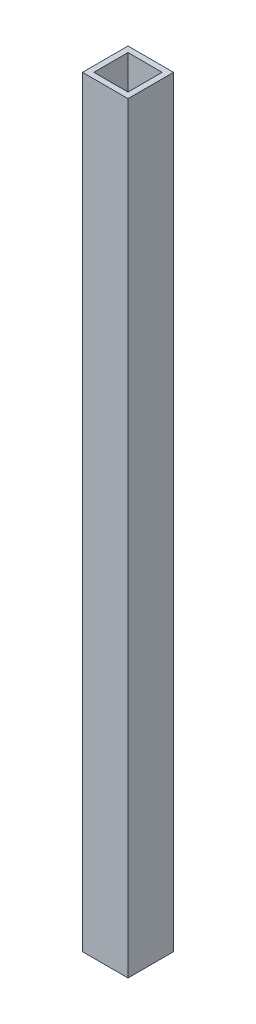
ISO-10303-21;
HEADER;
FILE_DESCRIPTION(('STEP AP214'),'2;1');
FILE_NAME('part.step','',(''),(''),'','','');
FILE_SCHEMA(('AUTOMOTIVE_DESIGN { 1 0 10303 214 1 1 1 1 }'));
ENDSEC;
DATA;
#1=APPLICATION_CONTEXT('core data for automotive mechanical design processes');
#2=APPLICATION_PROTOCOL_DEFINITION('international standard','automotive_design',2000,#1);
#3=PRODUCT_CONTEXT('',#1,'mechanical');
#4=PRODUCT('Part','Part','',(#3));
#5=PRODUCT_RELATED_PRODUCT_CATEGORY('part','',(#4));
#6=PRODUCT_DEFINITION_FORMATION('','',#4);
#7=PRODUCT_DEFINITION_CONTEXT('part definition',#1,'design');
#8=PRODUCT_DEFINITION('design','',#6,#7);
#9=PRODUCT_DEFINITION_SHAPE('','',#8);
#10=(LENGTH_UNIT() NAMED_UNIT(*) SI_UNIT(.MILLI.,.METRE.));
#11=(NAMED_UNIT(*) PLANE_ANGLE_UNIT() SI_UNIT($,.RADIAN.));
#12=(NAMED_UNIT(*) SI_UNIT($,.STERADIAN.) SOLID_ANGLE_UNIT());
#13=UNCERTAINTY_MEASURE_WITH_UNIT(LENGTH_MEASURE(1.E-05),#10,'distance_accuracy_value','');
#14=(GEOMETRIC_REPRESENTATION_CONTEXT(3) GLOBAL_UNCERTAINTY_ASSIGNED_CONTEXT((#13)) GLOBAL_UNIT_ASSIGNED_CONTEXT((#10,
#11,#12)) REPRESENTATION_CONTEXT('',''));
#15=CARTESIAN_POINT('',(0.,0.,0.));
#16=DIRECTION('',(0.,0.,1.));
#17=DIRECTION('',(1.,0.,0.));
#18=AXIS2_PLACEMENT_3D('',#15,#16,#17);
#19=CARTESIAN_POINT('',(0.,424.434,12.7));
#20=DIRECTION('',(0.,0.,-1.));
#21=DIRECTION('',(-1.,0.,0.));
#22=AXIS2_PLACEMENT_3D('',#19,#20,#21);
#23=PLANE('',#22);
#24=DIRECTION('',(1.,0.,0.));
#25=VECTOR('',#24,1.);
#26=CARTESIAN_POINT('',(0.,0.,12.7));
#27=LINE('',#26,#25);
#28=CARTESIAN_POINT('',(-12.7,0.,12.7));
#29=VERTEX_POINT('',#28);
#30=CARTESIAN_POINT('',(12.7,0.,12.7));
#31=VERTEX_POINT('',#30);
#32=EDGE_CURVE('E142',#29,#31,#27,.T.);
#33=ORIENTED_EDGE('',*,*,#32,.T.);
#34=DIRECTION('',(0.,-1.,0.));
#35=VECTOR('',#34,1.);
#36=CARTESIAN_POINT('',(12.7,424.434,12.7));
#37=LINE('',#36,#35);
#38=CARTESIAN_POINT('',(12.7,424.434,12.7));
#39=VERTEX_POINT('',#38);
#40=EDGE_CURVE('E11',#39,#31,#37,.T.);
#41=ORIENTED_EDGE('',*,*,#40,.F.);
#42=DIRECTION('',(1.,0.,0.));
#43=VECTOR('',#42,1.);
#44=CARTESIAN_POINT('',(0.,424.434,12.7));
#45=LINE('',#44,#43);
#46=CARTESIAN_POINT('',(-12.7,424.434,12.7));
#47=VERTEX_POINT('',#46);
#48=EDGE_CURVE('E114',#47,#39,#45,.T.);
#49=ORIENTED_EDGE('',*,*,#48,.F.);
#50=DIRECTION('',(0.,-1.,0.));
#51=VECTOR('',#50,1.);
#52=CARTESIAN_POINT('',(-12.7,424.434,12.7));
#53=LINE('',#52,#51);
#54=EDGE_CURVE('E54',#47,#29,#53,.T.);
#55=ORIENTED_EDGE('',*,*,#54,.T.);
#56=EDGE_LOOP('',(#33,#41,#49,#55));
#57=FACE_BOUND('',#56,.T.);
#58=ADVANCED_FACE('F35',(#57),#23,.F.);
#59=CARTESIAN_POINT('',(12.7,424.434,0.));
#60=DIRECTION('',(-1.,0.,0.));
#61=DIRECTION('',(0.,0.,1.));
#62=AXIS2_PLACEMENT_3D('',#59,#60,#61);
#63=PLANE('',#62);
#64=DIRECTION('',(0.,0.,-1.));
#65=VECTOR('',#64,1.);
#66=CARTESIAN_POINT('',(12.7,0.,0.));
#67=LINE('',#66,#65);
#68=CARTESIAN_POINT('',(12.7,0.,-12.7));
#69=VERTEX_POINT('',#68);
#70=EDGE_CURVE('E120',#31,#69,#67,.T.);
#71=ORIENTED_EDGE('',*,*,#70,.T.);
#72=DIRECTION('',(0.,-1.,0.));
#73=VECTOR('',#72,1.);
#74=CARTESIAN_POINT('',(12.7,424.434,-12.7));
#75=LINE('',#74,#73);
#76=CARTESIAN_POINT('',(12.7,424.434,-12.7));
#77=VERTEX_POINT('',#76);
#78=EDGE_CURVE('E45',#77,#69,#75,.T.);
#79=ORIENTED_EDGE('',*,*,#78,.F.);
#80=DIRECTION('',(0.,0.,-1.));
#81=VECTOR('',#80,1.);
#82=CARTESIAN_POINT('',(12.7,424.434,0.));
#83=LINE('',#82,#81);
#84=EDGE_CURVE('E108',#39,#77,#83,.T.);
#85=ORIENTED_EDGE('',*,*,#84,.F.);
#86=ORIENTED_EDGE('',*,*,#40,.T.);
#87=EDGE_LOOP('',(#71,#79,#85,#86));
#88=FACE_BOUND('',#87,.T.);
#89=ADVANCED_FACE('F119',(#88),#63,.F.);
#90=CARTESIAN_POINT('',(0.,424.434,-12.7));
#91=DIRECTION('',(0.,0.,-1.));
#92=DIRECTION('',(-1.,0.,0.));
#93=AXIS2_PLACEMENT_3D('',#90,#91,#92);
#94=PLANE('',#93);
#95=DIRECTION('',(1.,0.,0.));
#96=VECTOR('',#95,1.);
#97=CARTESIAN_POINT('',(0.,0.,-12.7));
#98=LINE('',#97,#96);
#99=CARTESIAN_POINT('',(-12.7,0.,-12.7));
#100=VERTEX_POINT('',#99);
#101=EDGE_CURVE('E145',#100,#69,#98,.T.);
#102=ORIENTED_EDGE('',*,*,#101,.F.);
#103=DIRECTION('',(0.,-1.,0.));
#104=VECTOR('',#103,1.);
#105=CARTESIAN_POINT('',(-12.7,424.434,-12.7));
#106=LINE('',#105,#104);
#107=CARTESIAN_POINT('',(-12.7,424.434,-12.7));
#108=VERTEX_POINT('',#107);
#109=EDGE_CURVE('E80',#108,#100,#106,.T.);
#110=ORIENTED_EDGE('',*,*,#109,.F.);
#111=DIRECTION('',(1.,0.,0.));
#112=VECTOR('',#111,1.);
#113=CARTESIAN_POINT('',(0.,424.434,-12.7));
#114=LINE('',#113,#112);
#115=EDGE_CURVE('E113',#108,#77,#114,.T.);
#116=ORIENTED_EDGE('',*,*,#115,.T.);
#117=ORIENTED_EDGE('',*,*,#78,.T.);
#118=EDGE_LOOP('',(#102,#110,#116,#117));
#119=FACE_BOUND('',#118,.T.);
#120=ADVANCED_FACE('F124',(#119),#94,.T.);
#121=CARTESIAN_POINT('',(0.,424.434,9.525));
#122=DIRECTION('',(0.,0.,-1.));
#123=DIRECTION('',(-1.,0.,0.));
#124=AXIS2_PLACEMENT_3D('',#121,#122,#123);
#125=PLANE('',#124);
#126=DIRECTION('',(1.,0.,0.));
#127=VECTOR('',#126,1.);
#128=CARTESIAN_POINT('',(0.,0.,9.525));
#129=LINE('',#128,#127);
#130=CARTESIAN_POINT('',(-9.525,0.,9.525));
#131=VERTEX_POINT('',#130);
#132=CARTESIAN_POINT('',(9.525,0.,9.525));
#133=VERTEX_POINT('',#132);
#134=EDGE_CURVE('E131',#131,#133,#129,.T.);
#135=ORIENTED_EDGE('',*,*,#134,.F.);
#136=DIRECTION('',(0.,-1.,0.));
#137=VECTOR('',#136,1.);
#138=CARTESIAN_POINT('',(-9.525,424.434,9.525));
#139=LINE('',#138,#137);
#140=CARTESIAN_POINT('',(-9.525,424.434,9.525));
#141=VERTEX_POINT('',#140);
#142=EDGE_CURVE('E39',#141,#131,#139,.T.);
#143=ORIENTED_EDGE('',*,*,#142,.F.);
#144=DIRECTION('',(1.,0.,0.));
#145=VECTOR('',#144,1.);
#146=CARTESIAN_POINT('',(0.,424.434,9.525));
#147=LINE('',#146,#145);
#148=CARTESIAN_POINT('',(9.525,424.434,9.525));
#149=VERTEX_POINT('',#148);
#150=EDGE_CURVE('E150',#141,#149,#147,.T.);
#151=ORIENTED_EDGE('',*,*,#150,.T.);
#152=DIRECTION('',(0.,-1.,0.));
#153=VECTOR('',#152,1.);
#154=CARTESIAN_POINT('',(9.525,424.434,9.525));
#155=LINE('',#154,#153);
#156=EDGE_CURVE('E127',#149,#133,#155,.T.);
#157=ORIENTED_EDGE('',*,*,#156,.T.);
#158=EDGE_LOOP('',(#135,#143,#151,#157));
#159=FACE_BOUND('',#158,.T.);
#160=ADVANCED_FACE('F37',(#159),#125,.T.);
#161=CARTESIAN_POINT('',(-9.525,424.434,0.));
#162=DIRECTION('',(-1.,0.,0.));
#163=DIRECTION('',(0.,0.,1.));
#164=AXIS2_PLACEMENT_3D('',#161,#162,#163);
#165=PLANE('',#164);
#166=DIRECTION('',(0.,0.,-1.));
#167=VECTOR('',#166,1.);
#168=CARTESIAN_POINT('',(-9.525,0.,0.));
#169=LINE('',#168,#167);
#170=CARTESIAN_POINT('',(-9.525,0.,-9.525));
#171=VERTEX_POINT('',#170);
#172=EDGE_CURVE('E134',#131,#171,#169,.T.);
#173=ORIENTED_EDGE('',*,*,#172,.T.);
#174=DIRECTION('',(0.,-1.,0.));
#175=VECTOR('',#174,1.);
#176=CARTESIAN_POINT('',(-9.525,424.434,-9.525));
#177=LINE('',#176,#175);
#178=CARTESIAN_POINT('',(-9.525,424.434,-9.525));
#179=VERTEX_POINT('',#178);
#180=EDGE_CURVE('E155',#179,#171,#177,.T.);
#181=ORIENTED_EDGE('',*,*,#180,.F.);
#182=DIRECTION('',(0.,0.,-1.));
#183=VECTOR('',#182,1.);
#184=CARTESIAN_POINT('',(-9.525,424.434,0.));
#185=LINE('',#184,#183);
#186=EDGE_CURVE('E164',#141,#179,#185,.T.);
#187=ORIENTED_EDGE('',*,*,#186,.F.);
#188=ORIENTED_EDGE('',*,*,#142,.T.);
#189=EDGE_LOOP('',(#173,#181,#187,#188));
#190=FACE_BOUND('',#189,.T.);
#191=ADVANCED_FACE('F163',(#190),#165,.F.);
#192=CARTESIAN_POINT('',(0.,424.434,-9.525));
#193=DIRECTION('',(0.,0.,-1.));
#194=DIRECTION('',(-1.,0.,0.));
#195=AXIS2_PLACEMENT_3D('',#192,#193,#194);
#196=PLANE('',#195);
#197=DIRECTION('',(1.,0.,0.));
#198=VECTOR('',#197,1.);
#199=CARTESIAN_POINT('',(0.,0.,-9.525));
#200=LINE('',#199,#198);
#201=CARTESIAN_POINT('',(9.525,0.,-9.525));
#202=VERTEX_POINT('',#201);
#203=EDGE_CURVE('E136',#171,#202,#200,.T.);
#204=ORIENTED_EDGE('',*,*,#203,.T.);
#205=DIRECTION('',(0.,-1.,0.));
#206=VECTOR('',#205,1.);
#207=CARTESIAN_POINT('',(9.525,424.434,-9.525));
#208=LINE('',#207,#206);
#209=CARTESIAN_POINT('',(9.525,424.434,-9.525));
#210=VERTEX_POINT('',#209);
#211=EDGE_CURVE('E154',#210,#202,#208,.T.);
#212=ORIENTED_EDGE('',*,*,#211,.F.);
#213=DIRECTION('',(1.,0.,0.));
#214=VECTOR('',#213,1.);
#215=CARTESIAN_POINT('',(0.,424.434,-9.525));
#216=LINE('',#215,#214);
#217=EDGE_CURVE('E203',#179,#210,#216,.T.);
#218=ORIENTED_EDGE('',*,*,#217,.F.);
#219=ORIENTED_EDGE('',*,*,#180,.T.);
#220=EDGE_LOOP('',(#204,#212,#218,#219));
#221=FACE_BOUND('',#220,.T.);
#222=ADVANCED_FACE('F176',(#221),#196,.F.);
#223=CARTESIAN_POINT('',(9.525,424.434,0.));
#224=DIRECTION('',(-1.,0.,0.));
#225=DIRECTION('',(0.,0.,1.));
#226=AXIS2_PLACEMENT_3D('',#223,#224,#225);
#227=PLANE('',#226);
#228=DIRECTION('',(0.,0.,-1.));
#229=VECTOR('',#228,1.);
#230=CARTESIAN_POINT('',(9.525,0.,0.));
#231=LINE('',#230,#229);
#232=EDGE_CURVE('E139',#133,#202,#231,.T.);
#233=ORIENTED_EDGE('',*,*,#232,.F.);
#234=ORIENTED_EDGE('',*,*,#156,.F.);
#235=DIRECTION('',(0.,0.,-1.));
#236=VECTOR('',#235,1.);
#237=CARTESIAN_POINT('',(9.525,424.434,0.));
#238=LINE('',#237,#236);
#239=EDGE_CURVE('E174',#149,#210,#238,.T.);
#240=ORIENTED_EDGE('',*,*,#239,.T.);
#241=ORIENTED_EDGE('',*,*,#211,.T.);
#242=EDGE_LOOP('',(#233,#234,#240,#241));
#243=FACE_BOUND('',#242,.T.);
#244=ADVANCED_FACE('F173',(#243),#227,.T.);
#245=CARTESIAN_POINT('',(-12.7,424.434,0.));
#246=DIRECTION('',(-1.,0.,0.));
#247=DIRECTION('',(0.,0.,1.));
#248=AXIS2_PLACEMENT_3D('',#245,#246,#247);
#249=PLANE('',#248);
#250=DIRECTION('',(0.,0.,-1.));
#251=VECTOR('',#250,1.);
#252=CARTESIAN_POINT('',(-12.7,0.,0.));
#253=LINE('',#252,#251);
#254=EDGE_CURVE('E147',#29,#100,#253,.T.);
#255=ORIENTED_EDGE('',*,*,#254,.F.);
#256=ORIENTED_EDGE('',*,*,#54,.F.);
#257=DIRECTION('',(0.,0.,-1.));
#258=VECTOR('',#257,1.);
#259=CARTESIAN_POINT('',(-12.7,424.434,0.));
#260=LINE('',#259,#258);
#261=EDGE_CURVE('E125',#47,#108,#260,.T.);
#262=ORIENTED_EDGE('',*,*,#261,.T.);
#263=ORIENTED_EDGE('',*,*,#109,.T.);
#264=EDGE_LOOP('',(#255,#256,#262,#263));
#265=FACE_BOUND('',#264,.T.);
#266=ADVANCED_FACE('F183',(#265),#249,.T.);
#267=CARTESIAN_POINT('',(0.,424.434,0.));
#268=DIRECTION('',(0.,1.,0.));
#269=DIRECTION('',(0.,0.,1.));
#270=AXIS2_PLACEMENT_3D('',#267,#268,#269);
#271=PLANE('',#270);
#272=ORIENTED_EDGE('',*,*,#150,.F.);
#273=ORIENTED_EDGE('',*,*,#186,.T.);
#274=ORIENTED_EDGE('',*,*,#217,.T.);
#275=ORIENTED_EDGE('',*,*,#239,.F.);
#276=EDGE_LOOP('',(#272,#273,#274,#275));
#277=FACE_BOUND('',#276,.T.);
#278=ORIENTED_EDGE('',*,*,#48,.T.);
#279=ORIENTED_EDGE('',*,*,#84,.T.);
#280=ORIENTED_EDGE('',*,*,#115,.F.);
#281=ORIENTED_EDGE('',*,*,#261,.F.);
#282=EDGE_LOOP('',(#278,#279,#280,#281));
#283=FACE_BOUND('',#282,.T.);
#284=ADVANCED_FACE('F110',(#277,#283),#271,.T.);
#285=CARTESIAN_POINT('',(0.,0.,0.));
#286=DIRECTION('',(0.,1.,0.));
#287=DIRECTION('',(0.,0.,1.));
#288=AXIS2_PLACEMENT_3D('',#285,#286,#287);
#289=PLANE('',#288);
#290=ORIENTED_EDGE('',*,*,#134,.T.);
#291=ORIENTED_EDGE('',*,*,#232,.T.);
#292=ORIENTED_EDGE('',*,*,#203,.F.);
#293=ORIENTED_EDGE('',*,*,#172,.F.);
#294=EDGE_LOOP('',(#290,#291,#292,#293));
#295=FACE_BOUND('',#294,.T.);
#296=ORIENTED_EDGE('',*,*,#32,.F.);
#297=ORIENTED_EDGE('',*,*,#254,.T.);
#298=ORIENTED_EDGE('',*,*,#101,.T.);
#299=ORIENTED_EDGE('',*,*,#70,.F.);
#300=EDGE_LOOP('',(#296,#297,#298,#299));
#301=FACE_BOUND('',#300,.T.);
#302=ADVANCED_FACE('F167',(#295,#301),#289,.F.);
#303=CLOSED_SHELL('',(#58,#89,#120,#160,#191,#222,#244,#266,#284,#302));
#304=MANIFOLD_SOLID_BREP('B2',#303);
#305=ADVANCED_BREP_SHAPE_REPRESENTATION('',(#18,#304),#14);
#306=SHAPE_DEFINITION_REPRESENTATION(#9,#305);
ENDSEC;
END-ISO-10303-21;
